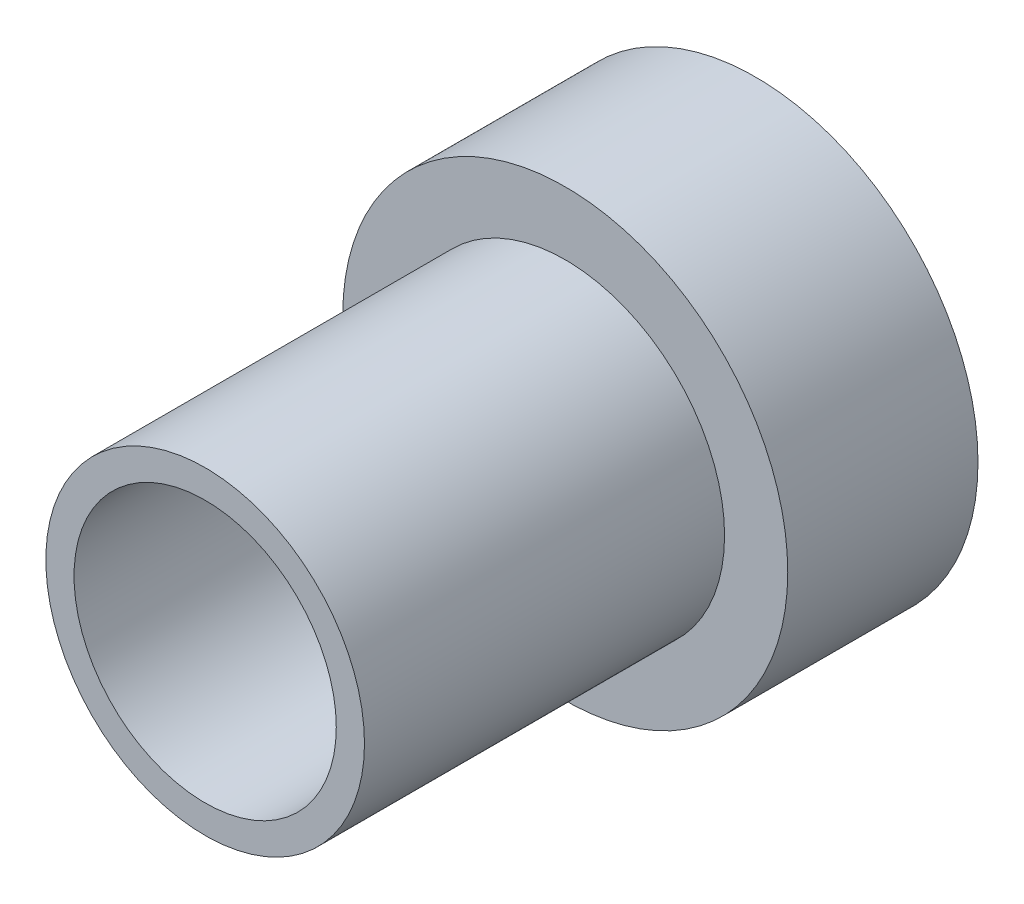
ISO-10303-21;
HEADER;
FILE_DESCRIPTION(('STEP AP214'),'2;1');
FILE_NAME('part.step','',(''),(''),'','','');
FILE_SCHEMA(('AUTOMOTIVE_DESIGN { 1 0 10303 214 1 1 1 1 }'));
ENDSEC;
DATA;
#1=APPLICATION_CONTEXT('core data for automotive mechanical design processes');
#2=APPLICATION_PROTOCOL_DEFINITION('international standard','automotive_design',2000,#1);
#3=PRODUCT_CONTEXT('',#1,'mechanical');
#4=PRODUCT('Part','Part','',(#3));
#5=PRODUCT_RELATED_PRODUCT_CATEGORY('part','',(#4));
#6=PRODUCT_DEFINITION_FORMATION('','',#4);
#7=PRODUCT_DEFINITION_CONTEXT('part definition',#1,'design');
#8=PRODUCT_DEFINITION('design','',#6,#7);
#9=PRODUCT_DEFINITION_SHAPE('','',#8);
#10=(LENGTH_UNIT() NAMED_UNIT(*) SI_UNIT(.MILLI.,.METRE.));
#11=(NAMED_UNIT(*) PLANE_ANGLE_UNIT() SI_UNIT($,.RADIAN.));
#12=(NAMED_UNIT(*) SI_UNIT($,.STERADIAN.) SOLID_ANGLE_UNIT());
#13=UNCERTAINTY_MEASURE_WITH_UNIT(LENGTH_MEASURE(1.E-05),#10,'distance_accuracy_value','');
#14=(GEOMETRIC_REPRESENTATION_CONTEXT(3) GLOBAL_UNCERTAINTY_ASSIGNED_CONTEXT((#13)) GLOBAL_UNIT_ASSIGNED_CONTEXT((#10,
#11,#12)) REPRESENTATION_CONTEXT('',''));
#15=CARTESIAN_POINT('',(0.,0.,0.));
#16=DIRECTION('',(0.,0.,1.));
#17=DIRECTION('',(1.,0.,0.));
#18=AXIS2_PLACEMENT_3D('',#15,#16,#17);
#19=CARTESIAN_POINT('',(0.,0.,10.287));
#20=DIRECTION('',(0.,0.,1.));
#21=DIRECTION('',(1.,0.,0.));
#22=AXIS2_PLACEMENT_3D('',#19,#20,#21);
#23=PLANE('',#22);
#24=CARTESIAN_POINT('',(0.,0.,10.287));
#25=DIRECTION('',(0.,0.,1.));
#26=DIRECTION('',(1.,0.,0.));
#27=AXIS2_PLACEMENT_3D('',#24,#25,#26);
#28=CIRCLE('',#27,2.4511);
#29=CARTESIAN_POINT('',(2.4511,0.,10.287));
#30=VERTEX_POINT('',#29);
#31=EDGE_CURVE('E48',#30,#30,#28,.T.);
#32=ORIENTED_EDGE('',*,*,#31,.F.);
#33=EDGE_LOOP('',(#32));
#34=FACE_BOUND('',#33,.T.);
#35=CARTESIAN_POINT('',(0.,0.,10.287));
#36=DIRECTION('',(0.,0.,1.));
#37=DIRECTION('',(1.,0.,0.));
#38=AXIS2_PLACEMENT_3D('',#35,#36,#37);
#39=CIRCLE('',#38,2.97815);
#40=CARTESIAN_POINT('',(2.97815,0.,10.287));
#41=VERTEX_POINT('',#40);
#42=EDGE_CURVE('E57',#41,#41,#39,.T.);
#43=ORIENTED_EDGE('',*,*,#42,.T.);
#44=EDGE_LOOP('',(#43));
#45=FACE_BOUND('',#44,.T.);
#46=ADVANCED_FACE('F33',(#34,#45),#23,.T.);
#47=CARTESIAN_POINT('',(0.,0.,10.287));
#48=DIRECTION('',(0.,0.,-1.));
#49=DIRECTION('',(-1.,0.,0.));
#50=AXIS2_PLACEMENT_3D('',#47,#48,#49);
#51=CYLINDRICAL_SURFACE('',#50,4.15925);
#52=CARTESIAN_POINT('',(0.,0.,0.));
#53=DIRECTION('',(0.,0.,1.));
#54=DIRECTION('',(1.,0.,0.));
#55=AXIS2_PLACEMENT_3D('',#52,#53,#54);
#56=CIRCLE('',#55,4.15925);
#57=CARTESIAN_POINT('',(4.15925,0.,0.));
#58=VERTEX_POINT('',#57);
#59=EDGE_CURVE('E44',#58,#58,#56,.T.);
#60=ORIENTED_EDGE('',*,*,#59,.T.);
#61=EDGE_LOOP('',(#60));
#62=FACE_BOUND('',#61,.T.);
#63=CARTESIAN_POINT('',(0.,0.,3.556));
#64=DIRECTION('',(0.,0.,1.));
#65=DIRECTION('',(1.,0.,0.));
#66=AXIS2_PLACEMENT_3D('',#63,#64,#65);
#67=CIRCLE('',#66,4.15925);
#68=CARTESIAN_POINT('',(4.15925,0.,3.556));
#69=VERTEX_POINT('',#68);
#70=EDGE_CURVE('E51',#69,#69,#67,.T.);
#71=ORIENTED_EDGE('',*,*,#70,.F.);
#72=EDGE_LOOP('',(#71));
#73=FACE_BOUND('',#72,.T.);
#74=ADVANCED_FACE('F73',(#62,#73),#51,.T.);
#75=CARTESIAN_POINT('',(0.,0.,0.));
#76=DIRECTION('',(0.,0.,1.));
#77=DIRECTION('',(1.,0.,0.));
#78=AXIS2_PLACEMENT_3D('',#75,#76,#77);
#79=PLANE('',#78);
#80=CARTESIAN_POINT('',(0.,0.,0.));
#81=DIRECTION('',(0.,0.,1.));
#82=DIRECTION('',(1.,0.,0.));
#83=AXIS2_PLACEMENT_3D('',#80,#81,#82);
#84=CIRCLE('',#83,3.79091910108277);
#85=CARTESIAN_POINT('',(3.79091910108277,0.,0.));
#86=VERTEX_POINT('',#85);
#87=EDGE_CURVE('E40',#86,#86,#84,.T.);
#88=ORIENTED_EDGE('',*,*,#87,.T.);
#89=EDGE_LOOP('',(#88));
#90=FACE_BOUND('',#89,.T.);
#91=ORIENTED_EDGE('',*,*,#59,.F.);
#92=EDGE_LOOP('',(#91));
#93=FACE_BOUND('',#92,.T.);
#94=ADVANCED_FACE('F75',(#90,#93),#79,.F.);
#95=CARTESIAN_POINT('',(0.,0.,10.287));
#96=DIRECTION('',(0.,0.,-1.));
#97=DIRECTION('',(-1.,0.,0.));
#98=AXIS2_PLACEMENT_3D('',#95,#96,#97);
#99=CYLINDRICAL_SURFACE('',#98,2.4511);
#100=CARTESIAN_POINT('',(0.,0.,1.77800000000001));
#101=DIRECTION('',(0.,0.,1.));
#102=DIRECTION('',(1.,0.,0.));
#103=AXIS2_PLACEMENT_3D('',#100,#101,#102);
#104=CIRCLE('',#103,2.4511);
#105=CARTESIAN_POINT('',(2.4511,0.,1.77800000000001));
#106=VERTEX_POINT('',#105);
#107=EDGE_CURVE('E11',#106,#106,#104,.F.);
#108=ORIENTED_EDGE('',*,*,#107,.T.);
#109=EDGE_LOOP('',(#108));
#110=FACE_BOUND('',#109,.T.);
#111=ORIENTED_EDGE('',*,*,#31,.T.);
#112=EDGE_LOOP('',(#111));
#113=FACE_BOUND('',#112,.T.);
#114=ADVANCED_FACE('F69',(#110,#113),#99,.F.);
#115=CARTESIAN_POINT('',(0.,0.,3.556));
#116=DIRECTION('',(0.,0.,1.));
#117=DIRECTION('',(1.,0.,0.));
#118=AXIS2_PLACEMENT_3D('',#115,#116,#117);
#119=PLANE('',#118);
#120=CARTESIAN_POINT('',(0.,0.,3.556));
#121=DIRECTION('',(0.,0.,1.));
#122=DIRECTION('',(1.,0.,0.));
#123=AXIS2_PLACEMENT_3D('',#120,#121,#122);
#124=CIRCLE('',#123,2.97815);
#125=CARTESIAN_POINT('',(2.97815,0.,3.556));
#126=VERTEX_POINT('',#125);
#127=EDGE_CURVE('E53',#126,#126,#124,.T.);
#128=ORIENTED_EDGE('',*,*,#127,.F.);
#129=EDGE_LOOP('',(#128));
#130=FACE_BOUND('',#129,.T.);
#131=ORIENTED_EDGE('',*,*,#70,.T.);
#132=EDGE_LOOP('',(#131));
#133=FACE_BOUND('',#132,.T.);
#134=ADVANCED_FACE('F66',(#130,#133),#119,.T.);
#135=CARTESIAN_POINT('',(0.,0.,3.556));
#136=DIRECTION('',(0.,0.,1.));
#137=DIRECTION('',(1.,0.,0.));
#138=AXIS2_PLACEMENT_3D('',#135,#136,#137);
#139=CYLINDRICAL_SURFACE('',#138,2.97815);
#140=ORIENTED_EDGE('',*,*,#127,.T.);
#141=EDGE_LOOP('',(#140));
#142=FACE_BOUND('',#141,.T.);
#143=ORIENTED_EDGE('',*,*,#42,.F.);
#144=EDGE_LOOP('',(#143));
#145=FACE_BOUND('',#144,.T.);
#146=ADVANCED_FACE('F63',(#142,#145),#139,.T.);
#147=CARTESIAN_POINT('',(0.,0.,0.));
#148=DIRECTION('',(0.,0.,-1.));
#149=DIRECTION('',(-1.,0.,0.));
#150=AXIS2_PLACEMENT_3D('',#147,#148,#149);
#151=CONICAL_SURFACE('',#150,3.79091910108277,0.6457718232379);
#152=ORIENTED_EDGE('',*,*,#107,.F.);
#153=EDGE_LOOP('',(#152));
#154=FACE_BOUND('',#153,.T.);
#155=ORIENTED_EDGE('',*,*,#87,.F.);
#156=EDGE_LOOP('',(#155));
#157=FACE_BOUND('',#156,.T.);
#158=ADVANCED_FACE('F35',(#154,#157),#151,.F.);
#159=CLOSED_SHELL('',(#46,#74,#94,#114,#134,#146,#158));
#160=MANIFOLD_SOLID_BREP('B2',#159);
#161=ADVANCED_BREP_SHAPE_REPRESENTATION('',(#18,#160),#14);
#162=SHAPE_DEFINITION_REPRESENTATION(#9,#161);
ENDSEC;
END-ISO-10303-21;
